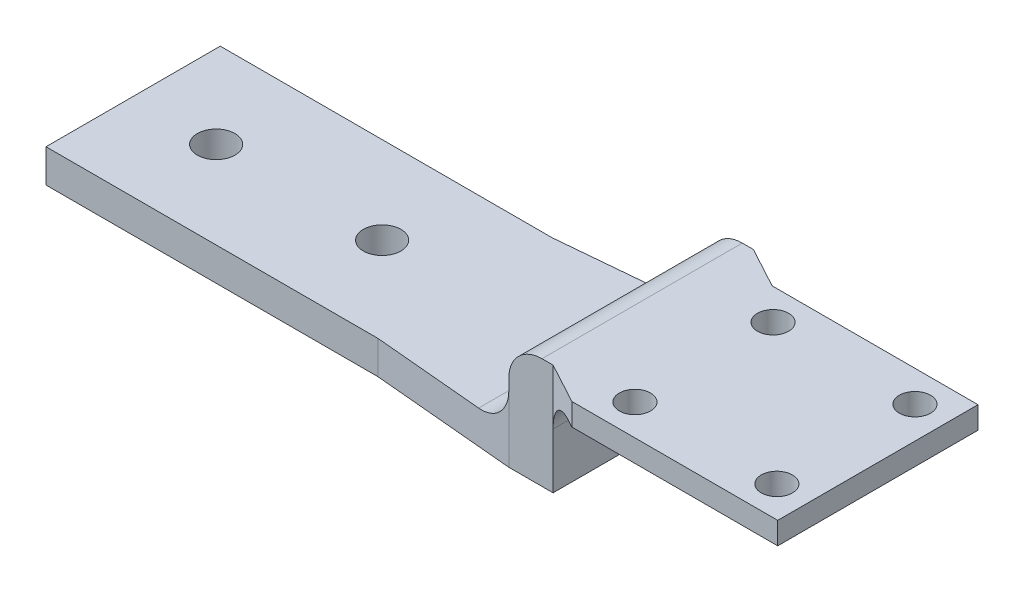
ISO-10303-21;
HEADER;
FILE_DESCRIPTION(('STEP AP214'),'2;1');
FILE_NAME('part.step','',(''),(''),'','','');
FILE_SCHEMA(('AUTOMOTIVE_DESIGN { 1 0 10303 214 1 1 1 1 }'));
ENDSEC;
DATA;
#1=APPLICATION_CONTEXT('core data for automotive mechanical design processes');
#2=APPLICATION_PROTOCOL_DEFINITION('international standard','automotive_design',2000,#1);
#3=PRODUCT_CONTEXT('',#1,'mechanical');
#4=PRODUCT('Part','Part','',(#3));
#5=PRODUCT_RELATED_PRODUCT_CATEGORY('part','',(#4));
#6=PRODUCT_DEFINITION_FORMATION('','',#4);
#7=PRODUCT_DEFINITION_CONTEXT('part definition',#1,'design');
#8=PRODUCT_DEFINITION('design','',#6,#7);
#9=PRODUCT_DEFINITION_SHAPE('','',#8);
#10=(LENGTH_UNIT() NAMED_UNIT(*) SI_UNIT(.MILLI.,.METRE.));
#11=(NAMED_UNIT(*) PLANE_ANGLE_UNIT() SI_UNIT($,.RADIAN.));
#12=(NAMED_UNIT(*) SI_UNIT($,.STERADIAN.) SOLID_ANGLE_UNIT());
#13=UNCERTAINTY_MEASURE_WITH_UNIT(LENGTH_MEASURE(1.E-05),#10,'distance_accuracy_value','');
#14=(GEOMETRIC_REPRESENTATION_CONTEXT(3) GLOBAL_UNCERTAINTY_ASSIGNED_CONTEXT((#13)) GLOBAL_UNIT_ASSIGNED_CONTEXT((#10,
#11,#12)) REPRESENTATION_CONTEXT('',''));
#15=CARTESIAN_POINT('',(0.,0.,0.));
#16=DIRECTION('',(0.,0.,1.));
#17=DIRECTION('',(1.,0.,0.));
#18=AXIS2_PLACEMENT_3D('',#15,#16,#17);
#19=CARTESIAN_POINT('',(59.69,1.905,0.));
#20=DIRECTION('',(1.,0.,0.));
#21=DIRECTION('',(0.,0.,-1.));
#22=AXIS2_PLACEMENT_3D('',#19,#20,#21);
#23=PLANE('',#22);
#24=DIRECTION('',(0.,-1.,0.));
#25=VECTOR('',#24,1.);
#26=CARTESIAN_POINT('',(59.69,1.90499999999998,-21.4935));
#27=LINE('',#26,#25);
#28=CARTESIAN_POINT('',(59.69,4.44499999999999,-21.4935));
#29=VERTEX_POINT('',#28);
#30=CARTESIAN_POINT('',(59.69,-1.90500000000002,-21.4935));
#31=VERTEX_POINT('',#30);
#32=EDGE_CURVE('E197',#29,#31,#27,.T.);
#33=ORIENTED_EDGE('',*,*,#32,.F.);
#34=DIRECTION('',(0.,0.,1.));
#35=VECTOR('',#34,1.);
#36=CARTESIAN_POINT('',(59.69,4.44499999999999,0.));
#37=LINE('',#36,#35);
#38=CARTESIAN_POINT('',(59.69,4.44499999999999,1.4935));
#39=VERTEX_POINT('',#38);
#40=EDGE_CURVE('E266',#29,#39,#37,.T.);
#41=ORIENTED_EDGE('',*,*,#40,.T.);
#42=DIRECTION('',(0.,-1.,0.));
#43=VECTOR('',#42,1.);
#44=CARTESIAN_POINT('',(59.69,1.90500000000001,1.4935));
#45=LINE('',#44,#43);
#46=CARTESIAN_POINT('',(59.69,-1.90499999999999,1.49350000000001));
#47=VERTEX_POINT('',#46);
#48=EDGE_CURVE('E194',#39,#47,#45,.T.);
#49=ORIENTED_EDGE('',*,*,#48,.T.);
#50=DIRECTION('',(0.,0.,1.));
#51=VECTOR('',#50,1.);
#52=CARTESIAN_POINT('',(59.69,-1.90499999999999,0.));
#53=LINE('',#52,#51);
#54=EDGE_CURVE('E167',#31,#47,#53,.T.);
#55=ORIENTED_EDGE('',*,*,#54,.F.);
#56=EDGE_LOOP('',(#33,#41,#49,#55));
#57=FACE_BOUND('',#56,.T.);
#58=ADVANCED_FACE('F45',(#57),#23,.T.);
#59=CARTESIAN_POINT('',(38.1,1.905,-20.));
#60=DIRECTION('',(0.,0.,-1.));
#61=DIRECTION('',(0.,1.,0.));
#62=AXIS2_PLACEMENT_3D('',#59,#60,#61);
#63=PLANE('',#62);
#64=DIRECTION('',(0.,-1.,0.));
#65=VECTOR('',#64,1.);
#66=CARTESIAN_POINT('',(0.,1.905,-20.));
#67=LINE('',#66,#65);
#68=CARTESIAN_POINT('',(0.,1.905,-20.));
#69=VERTEX_POINT('',#68);
#70=CARTESIAN_POINT('',(0.,-1.905,-20.));
#71=VERTEX_POINT('',#70);
#72=EDGE_CURVE('E211',#69,#71,#67,.T.);
#73=ORIENTED_EDGE('',*,*,#72,.F.);
#74=DIRECTION('',(-1.,0.,0.));
#75=VECTOR('',#74,1.);
#76=CARTESIAN_POINT('',(38.1,1.905,-20.));
#77=LINE('',#76,#75);
#78=CARTESIAN_POINT('',(38.1,1.905,-20.));
#79=VERTEX_POINT('',#78);
#80=EDGE_CURVE('E235',#79,#69,#77,.T.);
#81=ORIENTED_EDGE('',*,*,#80,.F.);
#82=DIRECTION('',(0.,-1.,0.));
#83=VECTOR('',#82,1.);
#84=CARTESIAN_POINT('',(38.1,1.905,-20.));
#85=LINE('',#84,#83);
#86=CARTESIAN_POINT('',(38.1,-1.905,-20.));
#87=VERTEX_POINT('',#86);
#88=EDGE_CURVE('E128',#79,#87,#85,.T.);
#89=ORIENTED_EDGE('',*,*,#88,.T.);
#90=DIRECTION('',(-1.,0.,0.));
#91=VECTOR('',#90,1.);
#92=CARTESIAN_POINT('',(38.1,-1.905,-20.));
#93=LINE('',#92,#91);
#94=EDGE_CURVE('E230',#87,#71,#93,.T.);
#95=ORIENTED_EDGE('',*,*,#94,.T.);
#96=EDGE_LOOP('',(#73,#81,#89,#95));
#97=FACE_BOUND('',#96,.T.);
#98=ADVANCED_FACE('F423',(#97),#63,.T.);
#99=CARTESIAN_POINT('',(38.1,1.905,0.));
#100=DIRECTION('',(0.,1.,0.));
#101=DIRECTION('',(0.,0.,1.));
#102=AXIS2_PLACEMENT_3D('',#99,#100,#101);
#103=PLANE('',#102);
#104=DIRECTION('',(0.995933405585129,0.,0.0900924616136522));
#105=VECTOR('',#104,1.);
#106=CARTESIAN_POINT('',(0.309244427469042,1.905,-3.41856410948367));
#107=LINE('',#106,#105);
#108=CARTESIAN_POINT('',(38.1,1.905,0.));
#109=VERTEX_POINT('',#108);
#110=CARTESIAN_POINT('',(50.8,1.90500000000001,1.14884615384616));
#111=VERTEX_POINT('',#110);
#112=EDGE_CURVE('E115',#109,#111,#107,.T.);
#113=ORIENTED_EDGE('',*,*,#112,.T.);
#114=DIRECTION('',(0.,0.,1.));
#115=VECTOR('',#114,1.);
#116=CARTESIAN_POINT('',(50.8,1.905,0.));
#117=LINE('',#116,#115);
#118=CARTESIAN_POINT('',(50.8,1.90499999999998,-21.1488461538462));
#119=VERTEX_POINT('',#118);
#120=EDGE_CURVE('E106',#111,#119,#117,.F.);
#121=ORIENTED_EDGE('',*,*,#120,.T.);
#122=DIRECTION('',(0.995933405585129,0.,-0.0900924616136508));
#123=VECTOR('',#122,1.);
#124=CARTESIAN_POINT('',(-1.48527741477958,1.90499999999999,-16.4191028577243));
#125=LINE('',#124,#123);
#126=EDGE_CURVE('E112',#79,#119,#125,.T.);
#127=ORIENTED_EDGE('',*,*,#126,.F.);
#128=ORIENTED_EDGE('',*,*,#80,.T.);
#129=DIRECTION('',(0.,0.,-1.));
#130=VECTOR('',#129,1.);
#131=CARTESIAN_POINT('',(0.,1.905,0.));
#132=LINE('',#131,#130);
#133=CARTESIAN_POINT('',(0.,1.905,0.));
#134=VERTEX_POINT('',#133);
#135=EDGE_CURVE('E223',#134,#69,#132,.T.);
#136=ORIENTED_EDGE('',*,*,#135,.F.);
#137=DIRECTION('',(-1.,0.,0.));
#138=VECTOR('',#137,1.);
#139=CARTESIAN_POINT('',(38.1,1.905,0.));
#140=LINE('',#139,#138);
#141=EDGE_CURVE('E238',#109,#134,#140,.T.);
#142=ORIENTED_EDGE('',*,*,#141,.F.);
#143=EDGE_LOOP('',(#113,#121,#127,#128,#136,#142));
#144=FACE_BOUND('',#143,.T.);
#145=CARTESIAN_POINT('',(28.575,1.905,-10.));
#146=DIRECTION('',(0.,1.,0.));
#147=DIRECTION('',(0.,0.,1.));
#148=AXIS2_PLACEMENT_3D('',#145,#146,#147);
#149=CIRCLE('',#148,2.15702401148296);
#150=CARTESIAN_POINT('',(28.575,1.905,-7.84297598851704));
#151=VERTEX_POINT('',#150);
#152=EDGE_CURVE('E203',#151,#151,#149,.T.);
#153=ORIENTED_EDGE('',*,*,#152,.F.);
#154=EDGE_LOOP('',(#153));
#155=FACE_BOUND('',#154,.T.);
#156=CARTESIAN_POINT('',(9.525,1.905,-10.));
#157=DIRECTION('',(0.,1.,0.));
#158=DIRECTION('',(0.,0.,1.));
#159=AXIS2_PLACEMENT_3D('',#156,#157,#158);
#160=CIRCLE('',#159,2.15702401148296);
#161=CARTESIAN_POINT('',(9.525,1.905,-7.84297598851705));
#162=VERTEX_POINT('',#161);
#163=EDGE_CURVE('E208',#162,#162,#160,.T.);
#164=ORIENTED_EDGE('',*,*,#163,.F.);
#165=EDGE_LOOP('',(#164));
#166=FACE_BOUND('',#165,.T.);
#167=ADVANCED_FACE('F108',(#144,#155,#166),#103,.T.);
#168=CARTESIAN_POINT('',(38.1,1.905,0.));
#169=DIRECTION('',(0.,0.,-1.));
#170=DIRECTION('',(0.,1.,0.));
#171=AXIS2_PLACEMENT_3D('',#168,#169,#170);
#172=PLANE('',#171);
#173=DIRECTION('',(0.,-1.,0.));
#174=VECTOR('',#173,1.);
#175=CARTESIAN_POINT('',(0.,1.905,0.));
#176=LINE('',#175,#174);
#177=CARTESIAN_POINT('',(0.,-1.90499999999999,0.));
#178=VERTEX_POINT('',#177);
#179=EDGE_CURVE('E219',#134,#178,#176,.T.);
#180=ORIENTED_EDGE('',*,*,#179,.T.);
#181=DIRECTION('',(-1.,0.,0.));
#182=VECTOR('',#181,1.);
#183=CARTESIAN_POINT('',(38.1,-1.90499999999999,0.));
#184=LINE('',#183,#182);
#185=CARTESIAN_POINT('',(38.1,-1.90499999999999,0.));
#186=VERTEX_POINT('',#185);
#187=EDGE_CURVE('E214',#186,#178,#184,.T.);
#188=ORIENTED_EDGE('',*,*,#187,.F.);
#189=DIRECTION('',(0.,-1.,0.));
#190=VECTOR('',#189,1.);
#191=CARTESIAN_POINT('',(38.1,1.905,0.));
#192=LINE('',#191,#190);
#193=EDGE_CURVE('E158',#109,#186,#192,.T.);
#194=ORIENTED_EDGE('',*,*,#193,.F.);
#195=ORIENTED_EDGE('',*,*,#141,.T.);
#196=EDGE_LOOP('',(#180,#188,#194,#195));
#197=FACE_BOUND('',#196,.T.);
#198=ADVANCED_FACE('F466',(#197),#172,.F.);
#199=CARTESIAN_POINT('',(38.1,-1.905,-4.91999999999996));
#200=DIRECTION('',(0.,-1.,0.));
#201=DIRECTION('',(0.,0.,-1.));
#202=AXIS2_PLACEMENT_3D('',#199,#200,#201);
#203=PLANE('',#202);
#204=CARTESIAN_POINT('',(9.525,-1.90500000000001,-10.));
#205=DIRECTION('',(0.,-1.,0.));
#206=DIRECTION('',(0.,0.,-1.));
#207=AXIS2_PLACEMENT_3D('',#204,#205,#206);
#208=CIRCLE('',#207,3.21475100000001);
#209=CARTESIAN_POINT('',(9.525,-1.90500000000001,-13.214751));
#210=VERTEX_POINT('',#209);
#211=EDGE_CURVE('E258',#210,#210,#208,.F.);
#212=ORIENTED_EDGE('',*,*,#211,.T.);
#213=EDGE_LOOP('',(#212));
#214=FACE_BOUND('',#213,.T.);
#215=CARTESIAN_POINT('',(28.575,-1.90500000000001,-10.));
#216=DIRECTION('',(0.,-1.,0.));
#217=DIRECTION('',(0.,0.,-1.));
#218=AXIS2_PLACEMENT_3D('',#215,#216,#217);
#219=CIRCLE('',#218,3.21475100000001);
#220=CARTESIAN_POINT('',(28.575,-1.90500000000001,-13.214751));
#221=VERTEX_POINT('',#220);
#222=EDGE_CURVE('E254',#221,#221,#219,.F.);
#223=ORIENTED_EDGE('',*,*,#222,.T.);
#224=EDGE_LOOP('',(#223));
#225=FACE_BOUND('',#224,.T.);
#226=DIRECTION('',(0.,0.,1.));
#227=VECTOR('',#226,1.);
#228=CARTESIAN_POINT('',(0.,-1.905,-4.91999999999996));
#229=LINE('',#228,#227);
#230=EDGE_CURVE('E215',#71,#178,#229,.T.);
#231=ORIENTED_EDGE('',*,*,#230,.F.);
#232=ORIENTED_EDGE('',*,*,#94,.F.);
#233=DIRECTION('',(0.995933405585129,0.,-0.0900924616136508));
#234=VECTOR('',#233,1.);
#235=CARTESIAN_POINT('',(-1.48527741477958,-1.90500000000001,-16.4191028577243));
#236=LINE('',#235,#234);
#237=CARTESIAN_POINT('',(54.61,-1.90500000000002,-21.4935));
#238=VERTEX_POINT('',#237);
#239=EDGE_CURVE('E176',#87,#238,#236,.T.);
#240=ORIENTED_EDGE('',*,*,#239,.T.);
#241=DIRECTION('',(1.,0.,0.));
#242=VECTOR('',#241,1.);
#243=CARTESIAN_POINT('',(0.,-1.90500000000002,-21.4935));
#244=LINE('',#243,#242);
#245=EDGE_CURVE('E180',#238,#31,#244,.T.);
#246=ORIENTED_EDGE('',*,*,#245,.T.);
#247=ORIENTED_EDGE('',*,*,#54,.T.);
#248=DIRECTION('',(-1.,0.,0.));
#249=VECTOR('',#248,1.);
#250=CARTESIAN_POINT('',(0.,-1.90499999999999,1.49350000000001));
#251=LINE('',#250,#249);
#252=CARTESIAN_POINT('',(54.61,-1.90499999999999,1.49350000000001));
#253=VERTEX_POINT('',#252);
#254=EDGE_CURVE('E163',#47,#253,#251,.T.);
#255=ORIENTED_EDGE('',*,*,#254,.T.);
#256=DIRECTION('',(0.995933405585129,0.,0.0900924616136522));
#257=VECTOR('',#256,1.);
#258=CARTESIAN_POINT('',(0.309244427469042,-1.905,-3.41856410948366));
#259=LINE('',#258,#257);
#260=EDGE_CURVE('E173',#186,#253,#259,.T.);
#261=ORIENTED_EDGE('',*,*,#260,.F.);
#262=ORIENTED_EDGE('',*,*,#187,.T.);
#263=EDGE_LOOP('',(#231,#232,#240,#246,#247,#255,#261,#262));
#264=FACE_BOUND('',#263,.T.);
#265=ADVANCED_FACE('F461',(#214,#225,#264),#203,.T.);
#266=CARTESIAN_POINT('',(0.,0.,0.));
#267=DIRECTION('',(1.,0.,0.));
#268=DIRECTION('',(0.,0.,-1.));
#269=AXIS2_PLACEMENT_3D('',#266,#267,#268);
#270=PLANE('',#269);
#271=ORIENTED_EDGE('',*,*,#72,.T.);
#272=ORIENTED_EDGE('',*,*,#230,.T.);
#273=ORIENTED_EDGE('',*,*,#179,.F.);
#274=ORIENTED_EDGE('',*,*,#135,.T.);
#275=EDGE_LOOP('',(#271,#272,#273,#274));
#276=FACE_BOUND('',#275,.T.);
#277=ADVANCED_FACE('F458',(#276),#270,.F.);
#278=CARTESIAN_POINT('',(9.525,1.65099999999999,-10.));
#279=DIRECTION('',(0.,-1.,0.));
#280=DIRECTION('',(0.,0.,-1.));
#281=AXIS2_PLACEMENT_3D('',#278,#279,#280);
#282=CONICAL_SURFACE('',#281,2.579751,1.02974425867665);
#283=ORIENTED_EDGE('',*,*,#163,.T.);
#284=EDGE_LOOP('',(#283));
#285=FACE_BOUND('',#284,.T.);
#286=CARTESIAN_POINT('',(9.525,1.65099999999999,-10.));
#287=DIRECTION('',(0.,-1.,0.));
#288=DIRECTION('',(0.,0.,-1.));
#289=AXIS2_PLACEMENT_3D('',#286,#287,#288);
#290=CIRCLE('',#289,2.579751);
#291=CARTESIAN_POINT('',(9.525,1.65099999999999,-12.579751));
#292=VERTEX_POINT('',#291);
#293=EDGE_CURVE('E204',#292,#292,#290,.T.);
#294=ORIENTED_EDGE('',*,*,#293,.T.);
#295=EDGE_LOOP('',(#294));
#296=FACE_BOUND('',#295,.T.);
#297=ADVANCED_FACE('F454',(#285,#296),#282,.F.);
#298=CARTESIAN_POINT('',(9.525,-1.90500000000001,-10.));
#299=DIRECTION('',(0.,-1.,0.));
#300=DIRECTION('',(0.,0.,-1.));
#301=AXIS2_PLACEMENT_3D('',#298,#299,#300);
#302=CYLINDRICAL_SURFACE('',#301,2.579751);
#303=CARTESIAN_POINT('',(9.525,-1.53838257906459,-10.));
#304=DIRECTION('',(0.,-1.,0.));
#305=DIRECTION('',(0.,0.,-1.));
#306=AXIS2_PLACEMENT_3D('',#303,#304,#305);
#307=CIRCLE('',#306,2.579751);
#308=CARTESIAN_POINT('',(9.525,-1.53838257906459,-12.579751));
#309=VERTEX_POINT('',#308);
#310=EDGE_CURVE('E234',#309,#309,#307,.T.);
#311=ORIENTED_EDGE('',*,*,#310,.T.);
#312=EDGE_LOOP('',(#311));
#313=FACE_BOUND('',#312,.T.);
#314=ORIENTED_EDGE('',*,*,#293,.F.);
#315=EDGE_LOOP('',(#314));
#316=FACE_BOUND('',#315,.T.);
#317=ADVANCED_FACE('F450',(#313,#316),#302,.F.);
#318=CARTESIAN_POINT('',(28.575,1.65099999999999,-10.));
#319=DIRECTION('',(0.,-1.,0.));
#320=DIRECTION('',(0.,0.,-1.));
#321=AXIS2_PLACEMENT_3D('',#318,#319,#320);
#322=CONICAL_SURFACE('',#321,2.579751,1.02974425867665);
#323=ORIENTED_EDGE('',*,*,#152,.T.);
#324=EDGE_LOOP('',(#323));
#325=FACE_BOUND('',#324,.T.);
#326=CARTESIAN_POINT('',(28.575,1.65099999999999,-10.));
#327=DIRECTION('',(0.,-1.,0.));
#328=DIRECTION('',(0.,0.,-1.));
#329=AXIS2_PLACEMENT_3D('',#326,#327,#328);
#330=CIRCLE('',#329,2.579751);
#331=CARTESIAN_POINT('',(28.575,1.65099999999999,-12.579751));
#332=VERTEX_POINT('',#331);
#333=EDGE_CURVE('E189',#332,#332,#330,.T.);
#334=ORIENTED_EDGE('',*,*,#333,.T.);
#335=EDGE_LOOP('',(#334));
#336=FACE_BOUND('',#335,.T.);
#337=ADVANCED_FACE('F446',(#325,#336),#322,.F.);
#338=CARTESIAN_POINT('',(28.575,-1.90500000000001,-10.));
#339=DIRECTION('',(0.,-1.,0.));
#340=DIRECTION('',(0.,0.,-1.));
#341=AXIS2_PLACEMENT_3D('',#338,#339,#340);
#342=CYLINDRICAL_SURFACE('',#341,2.579751);
#343=CARTESIAN_POINT('',(28.575,-1.53838257906459,-10.));
#344=DIRECTION('',(0.,-1.,0.));
#345=DIRECTION('',(0.,0.,-1.));
#346=AXIS2_PLACEMENT_3D('',#343,#344,#345);
#347=CIRCLE('',#346,2.579751);
#348=CARTESIAN_POINT('',(28.575,-1.53838257906459,-12.579751));
#349=VERTEX_POINT('',#348);
#350=EDGE_CURVE('E262',#349,#349,#347,.T.);
#351=ORIENTED_EDGE('',*,*,#350,.T.);
#352=EDGE_LOOP('',(#351));
#353=FACE_BOUND('',#352,.T.);
#354=ORIENTED_EDGE('',*,*,#333,.F.);
#355=EDGE_LOOP('',(#354));
#356=FACE_BOUND('',#355,.T.);
#357=ADVANCED_FACE('F442',(#353,#356),#342,.F.);
#358=CARTESIAN_POINT('',(9.525,-1.53838257906459,-10.));
#359=DIRECTION('',(0.,-1.,0.));
#360=DIRECTION('',(0.,0.,-1.));
#361=AXIS2_PLACEMENT_3D('',#358,#359,#360);
#362=CONICAL_SURFACE('',#361,2.579751,1.0471975511966);
#363=ORIENTED_EDGE('',*,*,#211,.F.);
#364=EDGE_LOOP('',(#363));
#365=FACE_BOUND('',#364,.T.);
#366=ORIENTED_EDGE('',*,*,#310,.F.);
#367=EDGE_LOOP('',(#366));
#368=FACE_BOUND('',#367,.T.);
#369=ADVANCED_FACE('F445',(#365,#368),#362,.F.);
#370=CARTESIAN_POINT('',(28.575,-1.53838257906459,-10.));
#371=DIRECTION('',(0.,-1.,0.));
#372=DIRECTION('',(0.,0.,-1.));
#373=AXIS2_PLACEMENT_3D('',#370,#371,#372);
#374=CONICAL_SURFACE('',#373,2.579751,1.0471975511966);
#375=ORIENTED_EDGE('',*,*,#222,.F.);
#376=EDGE_LOOP('',(#375));
#377=FACE_BOUND('',#376,.T.);
#378=ORIENTED_EDGE('',*,*,#350,.F.);
#379=EDGE_LOOP('',(#378));
#380=FACE_BOUND('',#379,.T.);
#381=ADVANCED_FACE('F441',(#377,#380),#374,.F.);
#382=CARTESIAN_POINT('',(0.309244427469042,1.905,-3.41856410948367));
#383=DIRECTION('',(0.0900924616136522,0.,-0.995933405585129));
#384=DIRECTION('',(-0.995933405585129,0.,-0.0900924616136522));
#385=AXIS2_PLACEMENT_3D('',#382,#383,#384);
#386=PLANE('',#385);
#387=ORIENTED_EDGE('',*,*,#260,.T.);
#388=DIRECTION('',(0.,-1.,0.));
#389=VECTOR('',#388,1.);
#390=CARTESIAN_POINT('',(54.61,1.90500000000001,1.4935));
#391=LINE('',#390,#389);
#392=CARTESIAN_POINT('',(54.61,5.715,1.4935));
#393=VERTEX_POINT('',#392);
#394=EDGE_CURVE('E83',#393,#253,#391,.T.);
#395=ORIENTED_EDGE('',*,*,#394,.F.);
#396=CARTESIAN_POINT('',(50.8,5.715,1.14884615384615));
#397=DIRECTION('',(0.0900924616136522,0.,-0.995933405585129));
#398=DIRECTION('',(0.995933405585129,0.,0.0900924616136522));
#399=AXIS2_PLACEMENT_3D('',#396,#397,#398);
#400=ELLIPSE('',#399,3.82555698868395,3.81);
#401=EDGE_CURVE('E54',#393,#111,#400,.T.);
#402=ORIENTED_EDGE('',*,*,#401,.T.);
#403=ORIENTED_EDGE('',*,*,#112,.F.);
#404=ORIENTED_EDGE('',*,*,#193,.T.);
#405=EDGE_LOOP('',(#387,#395,#402,#403,#404));
#406=FACE_BOUND('',#405,.T.);
#407=ADVANCED_FACE('F153',(#406),#386,.F.);
#408=CARTESIAN_POINT('',(0.,1.90500000000001,1.49350000000001));
#409=DIRECTION('',(0.,0.,1.));
#410=DIRECTION('',(0.,-1.,0.));
#411=AXIS2_PLACEMENT_3D('',#408,#409,#410);
#412=PLANE('',#411);
#413=DIRECTION('',(1.,0.,0.));
#414=VECTOR('',#413,1.);
#415=CARTESIAN_POINT('',(59.69,10.795,1.4935));
#416=LINE('',#415,#414);
#417=CARTESIAN_POINT('',(58.42,10.795,1.4935));
#418=VERTEX_POINT('',#417);
#419=CARTESIAN_POINT('',(59.69,10.795,1.4935));
#420=VERTEX_POINT('',#419);
#421=EDGE_CURVE('E283',#418,#420,#416,.T.);
#422=ORIENTED_EDGE('',*,*,#421,.F.);
#423=CARTESIAN_POINT('',(58.42,6.985,1.4935));
#424=DIRECTION('',(0.,0.,1.));
#425=DIRECTION('',(0.,-1.,0.));
#426=AXIS2_PLACEMENT_3D('',#423,#424,#425);
#427=CIRCLE('',#426,3.81);
#428=CARTESIAN_POINT('',(54.61,6.985,1.4935));
#429=VERTEX_POINT('',#428);
#430=EDGE_CURVE('E94',#418,#429,#427,.T.);
#431=ORIENTED_EDGE('',*,*,#430,.T.);
#432=DIRECTION('',(0.,-1.,0.));
#433=VECTOR('',#432,1.);
#434=CARTESIAN_POINT('',(54.61,10.795,1.4935));
#435=LINE('',#434,#433);
#436=EDGE_CURVE('E294',#429,#393,#435,.T.);
#437=ORIENTED_EDGE('',*,*,#436,.T.);
#438=ORIENTED_EDGE('',*,*,#394,.T.);
#439=ORIENTED_EDGE('',*,*,#254,.F.);
#440=ORIENTED_EDGE('',*,*,#48,.F.);
#441=EDGE_CURVE('E190',#420,#39,#45,.T.);
#442=ORIENTED_EDGE('',*,*,#441,.F.);
#443=EDGE_LOOP('',(#422,#431,#437,#438,#439,#440,#442));
#444=FACE_BOUND('',#443,.T.);
#445=ADVANCED_FACE('F291',(#444),#412,.T.);
#446=CARTESIAN_POINT('',(0.,1.90499999999998,-21.4935));
#447=DIRECTION('',(0.,0.,-1.));
#448=DIRECTION('',(0.,1.,0.));
#449=AXIS2_PLACEMENT_3D('',#446,#447,#448);
#450=PLANE('',#449);
#451=DIRECTION('',(0.,-1.,0.));
#452=VECTOR('',#451,1.);
#453=CARTESIAN_POINT('',(54.61,10.795,-21.4935));
#454=LINE('',#453,#452);
#455=CARTESIAN_POINT('',(54.61,6.985,-21.4935));
#456=VERTEX_POINT('',#455);
#457=CARTESIAN_POINT('',(54.61,5.715,-21.4935));
#458=VERTEX_POINT('',#457);
#459=EDGE_CURVE('E170',#456,#458,#454,.T.);
#460=ORIENTED_EDGE('',*,*,#459,.F.);
#461=CARTESIAN_POINT('',(58.42,6.985,-21.4935));
#462=DIRECTION('',(0.,0.,-1.));
#463=DIRECTION('',(0.,1.,0.));
#464=AXIS2_PLACEMENT_3D('',#461,#462,#463);
#465=CIRCLE('',#464,3.81);
#466=CARTESIAN_POINT('',(58.42,10.795,-21.4935));
#467=VERTEX_POINT('',#466);
#468=EDGE_CURVE('E120',#456,#467,#465,.T.);
#469=ORIENTED_EDGE('',*,*,#468,.T.);
#470=DIRECTION('',(-1.,0.,0.));
#471=VECTOR('',#470,1.);
#472=CARTESIAN_POINT('',(59.69,10.795,-21.4935));
#473=LINE('',#472,#471);
#474=CARTESIAN_POINT('',(59.69,10.795,-21.4935));
#475=VERTEX_POINT('',#474);
#476=EDGE_CURVE('E286',#475,#467,#473,.T.);
#477=ORIENTED_EDGE('',*,*,#476,.F.);
#478=EDGE_CURVE('E69',#475,#29,#27,.T.);
#479=ORIENTED_EDGE('',*,*,#478,.T.);
#480=ORIENTED_EDGE('',*,*,#32,.T.);
#481=ORIENTED_EDGE('',*,*,#245,.F.);
#482=DIRECTION('',(0.,-1.,0.));
#483=VECTOR('',#482,1.);
#484=CARTESIAN_POINT('',(54.61,1.90499999999998,-21.4935));
#485=LINE('',#484,#483);
#486=EDGE_CURVE('E61',#458,#238,#485,.T.);
#487=ORIENTED_EDGE('',*,*,#486,.F.);
#488=EDGE_LOOP('',(#460,#469,#477,#479,#480,#481,#487));
#489=FACE_BOUND('',#488,.T.);
#490=ADVANCED_FACE('F434',(#489),#450,.T.);
#491=CARTESIAN_POINT('',(-1.48527741477958,1.90499999999999,-16.4191028577243));
#492=DIRECTION('',(-0.0900924616136508,0.,-0.995933405585129));
#493=DIRECTION('',(-0.995933405585129,0.,0.0900924616136508));
#494=AXIS2_PLACEMENT_3D('',#491,#492,#493);
#495=PLANE('',#494);
#496=ORIENTED_EDGE('',*,*,#239,.F.);
#497=ORIENTED_EDGE('',*,*,#88,.F.);
#498=ORIENTED_EDGE('',*,*,#126,.T.);
#499=CARTESIAN_POINT('',(50.8,5.715,-21.1488461538462));
#500=DIRECTION('',(-0.0900924616136508,0.,-0.995933405585129));
#501=DIRECTION('',(-0.995933405585129,0.,0.0900924616136508));
#502=AXIS2_PLACEMENT_3D('',#499,#500,#501);
#503=ELLIPSE('',#502,3.82555698868395,3.81);
#504=EDGE_CURVE('E11',#119,#458,#503,.F.);
#505=ORIENTED_EDGE('',*,*,#504,.T.);
#506=ORIENTED_EDGE('',*,*,#486,.T.);
#507=EDGE_LOOP('',(#496,#497,#498,#505,#506));
#508=FACE_BOUND('',#507,.T.);
#509=ADVANCED_FACE('F125',(#508),#495,.T.);
#510=CARTESIAN_POINT('',(54.61,10.795,-21.4935));
#511=DIRECTION('',(1.,0.,0.));
#512=DIRECTION('',(0.,0.,-1.));
#513=AXIS2_PLACEMENT_3D('',#510,#511,#512);
#514=PLANE('',#513);
#515=ORIENTED_EDGE('',*,*,#436,.F.);
#516=DIRECTION('',(0.,0.,1.));
#517=VECTOR('',#516,1.);
#518=CARTESIAN_POINT('',(54.61,6.985,-21.4935));
#519=LINE('',#518,#517);
#520=EDGE_CURVE('E135',#429,#456,#519,.F.);
#521=ORIENTED_EDGE('',*,*,#520,.T.);
#522=ORIENTED_EDGE('',*,*,#459,.T.);
#523=DIRECTION('',(0.,0.,1.));
#524=VECTOR('',#523,1.);
#525=CARTESIAN_POINT('',(54.61,5.715,-21.4935));
#526=LINE('',#525,#524);
#527=EDGE_CURVE('E132',#458,#393,#526,.T.);
#528=ORIENTED_EDGE('',*,*,#527,.T.);
#529=EDGE_LOOP('',(#515,#521,#522,#528));
#530=FACE_BOUND('',#529,.T.);
#531=ADVANCED_FACE('F400',(#530),#514,.F.);
#532=CARTESIAN_POINT('',(0.,10.795,0.));
#533=DIRECTION('',(0.,-1.,0.));
#534=DIRECTION('',(0.,0.,-1.));
#535=AXIS2_PLACEMENT_3D('',#532,#533,#534);
#536=PLANE('',#535);
#537=ORIENTED_EDGE('',*,*,#476,.T.);
#538=DIRECTION('',(0.,0.,1.));
#539=VECTOR('',#538,1.);
#540=CARTESIAN_POINT('',(58.42,10.795,0.));
#541=LINE('',#540,#539);
#542=EDGE_CURVE('E140',#467,#418,#541,.T.);
#543=ORIENTED_EDGE('',*,*,#542,.T.);
#544=ORIENTED_EDGE('',*,*,#421,.T.);
#545=DIRECTION('',(0.879706513576127,0.,0.475517034365474));
#546=VECTOR('',#545,1.);
#547=CARTESIAN_POINT('',(59.69,10.795,1.4935));
#548=LINE('',#547,#546);
#549=CARTESIAN_POINT('',(64.389,10.795,4.03350000000001));
#550=VERTEX_POINT('',#549);
#551=EDGE_CURVE('E333',#420,#550,#548,.T.);
#552=ORIENTED_EDGE('',*,*,#551,.T.);
#553=DIRECTION('',(1.,0.,0.));
#554=VECTOR('',#553,1.);
#555=CARTESIAN_POINT('',(64.389,10.795,4.03350000000001));
#556=LINE('',#555,#554);
#557=CARTESIAN_POINT('',(88.011,10.795,4.03350000000001));
#558=VERTEX_POINT('',#557);
#559=EDGE_CURVE('E329',#550,#558,#556,.T.);
#560=ORIENTED_EDGE('',*,*,#559,.T.);
#561=DIRECTION('',(0.,0.,-1.));
#562=VECTOR('',#561,1.);
#563=CARTESIAN_POINT('',(88.011,10.795,4.03350000000001));
#564=LINE('',#563,#562);
#565=CARTESIAN_POINT('',(88.011,10.795,-18.9535));
#566=VERTEX_POINT('',#565);
#567=EDGE_CURVE('E325',#558,#566,#564,.T.);
#568=ORIENTED_EDGE('',*,*,#567,.T.);
#569=DIRECTION('',(-1.,0.,0.));
#570=VECTOR('',#569,1.);
#571=CARTESIAN_POINT('',(64.389,10.795,-18.9535));
#572=LINE('',#571,#570);
#573=CARTESIAN_POINT('',(64.389,10.795,-18.9535));
#574=VERTEX_POINT('',#573);
#575=EDGE_CURVE('E321',#566,#574,#572,.T.);
#576=ORIENTED_EDGE('',*,*,#575,.T.);
#577=DIRECTION('',(-0.879706513576127,0.,-0.475517034365475));
#578=VECTOR('',#577,1.);
#579=CARTESIAN_POINT('',(64.389,10.795,-18.9535));
#580=LINE('',#579,#578);
#581=EDGE_CURVE('E317',#574,#475,#580,.T.);
#582=ORIENTED_EDGE('',*,*,#581,.T.);
#583=EDGE_LOOP('',(#537,#543,#544,#552,#560,#568,#576,#582));
#584=FACE_BOUND('',#583,.T.);
#585=CARTESIAN_POINT('',(68.0562828729282,10.795,0.464800000000005));
#586=DIRECTION('',(0.,1.,0.));
#587=DIRECTION('',(0.,0.,1.));
#588=AXIS2_PLACEMENT_3D('',#585,#586,#587);
#589=CIRCLE('',#588,1.79070000000001);
#590=CARTESIAN_POINT('',(68.0562828729282,10.795,2.25550000000001));
#591=VERTEX_POINT('',#590);
#592=EDGE_CURVE('E379',#591,#591,#589,.T.);
#593=ORIENTED_EDGE('',*,*,#592,.F.);
#594=EDGE_LOOP('',(#593));
#595=FACE_BOUND('',#594,.T.);
#596=CARTESIAN_POINT('',(84.3437171270718,10.795,0.464800000000005));
#597=DIRECTION('',(0.,1.,0.));
#598=DIRECTION('',(0.,0.,1.));
#599=AXIS2_PLACEMENT_3D('',#596,#597,#598);
#600=CIRCLE('',#599,1.79070000000001);
#601=CARTESIAN_POINT('',(84.3437171270718,10.795,2.25550000000001));
#602=VERTEX_POINT('',#601);
#603=EDGE_CURVE('E371',#602,#602,#600,.T.);
#604=ORIENTED_EDGE('',*,*,#603,.F.);
#605=EDGE_LOOP('',(#604));
#606=FACE_BOUND('',#605,.T.);
#607=CARTESIAN_POINT('',(84.3437171270718,10.795,-15.3848));
#608=DIRECTION('',(0.,1.,0.));
#609=DIRECTION('',(0.,0.,1.));
#610=AXIS2_PLACEMENT_3D('',#607,#608,#609);
#611=CIRCLE('',#610,1.79070000000001);
#612=CARTESIAN_POINT('',(84.3437171270718,10.795,-13.5941));
#613=VERTEX_POINT('',#612);
#614=EDGE_CURVE('E363',#613,#613,#611,.T.);
#615=ORIENTED_EDGE('',*,*,#614,.F.);
#616=EDGE_LOOP('',(#615));
#617=FACE_BOUND('',#616,.T.);
#618=CARTESIAN_POINT('',(68.0562828729282,10.795,-15.3848));
#619=DIRECTION('',(0.,1.,0.));
#620=DIRECTION('',(0.,0.,1.));
#621=AXIS2_PLACEMENT_3D('',#618,#619,#620);
#622=CIRCLE('',#621,1.79070000000001);
#623=CARTESIAN_POINT('',(68.0562828729282,10.795,-13.5941));
#624=VERTEX_POINT('',#623);
#625=EDGE_CURVE('E355',#624,#624,#622,.T.);
#626=ORIENTED_EDGE('',*,*,#625,.F.);
#627=EDGE_LOOP('',(#626));
#628=FACE_BOUND('',#627,.T.);
#629=ADVANCED_FACE('F279',(#584,#595,#606,#617,#628),#536,.F.);
#630=CARTESIAN_POINT('',(59.69,8.255,1.4935));
#631=DIRECTION('',(-0.475517034365474,0.,0.879706513576127));
#632=DIRECTION('',(0.879706513576127,0.,0.475517034365474));
#633=AXIS2_PLACEMENT_3D('',#630,#631,#632);
#634=PLANE('',#633);
#635=ORIENTED_EDGE('',*,*,#551,.F.);
#636=ORIENTED_EDGE('',*,*,#441,.T.);
#637=CARTESIAN_POINT('',(63.5,4.44499999999999,3.55295945945946));
#638=DIRECTION('',(-0.475517034365474,0.,0.879706513576127));
#639=DIRECTION('',(0.879706513576127,0.,0.475517034365474));
#640=AXIS2_PLACEMENT_3D('',#637,#638,#639);
#641=ELLIPSE('',#640,4.33098987128313,3.81);
#642=CARTESIAN_POINT('',(63.5,8.255,3.55295945945946));
#643=VERTEX_POINT('',#642);
#644=EDGE_CURVE('E119',#39,#643,#641,.F.);
#645=ORIENTED_EDGE('',*,*,#644,.T.);
#646=DIRECTION('',(0.879706513576127,0.,0.475517034365474));
#647=VECTOR('',#646,1.);
#648=CARTESIAN_POINT('',(59.69,8.255,1.4935));
#649=LINE('',#648,#647);
#650=CARTESIAN_POINT('',(64.389,8.255,4.03350000000001));
#651=VERTEX_POINT('',#650);
#652=EDGE_CURVE('E320',#643,#651,#649,.T.);
#653=ORIENTED_EDGE('',*,*,#652,.T.);
#654=DIRECTION('',(0.,1.,0.));
#655=VECTOR('',#654,1.);
#656=CARTESIAN_POINT('',(64.389,8.255,4.03350000000001));
#657=LINE('',#656,#655);
#658=EDGE_CURVE('E301',#651,#550,#657,.T.);
#659=ORIENTED_EDGE('',*,*,#658,.T.);
#660=EDGE_LOOP('',(#635,#636,#645,#653,#659));
#661=FACE_BOUND('',#660,.T.);
#662=ADVANCED_FACE('F399',(#661),#634,.T.);
#663=CARTESIAN_POINT('',(64.389,8.255,-18.9535));
#664=DIRECTION('',(0.475517034365475,0.,-0.879706513576127));
#665=DIRECTION('',(-0.879706513576127,0.,-0.475517034365475));
#666=AXIS2_PLACEMENT_3D('',#663,#664,#665);
#667=PLANE('',#666);
#668=ORIENTED_EDGE('',*,*,#581,.F.);
#669=DIRECTION('',(0.,1.,0.));
#670=VECTOR('',#669,1.);
#671=CARTESIAN_POINT('',(64.389,8.255,-18.9535));
#672=LINE('',#671,#670);
#673=CARTESIAN_POINT('',(64.389,8.255,-18.9535));
#674=VERTEX_POINT('',#673);
#675=EDGE_CURVE('E298',#674,#574,#672,.T.);
#676=ORIENTED_EDGE('',*,*,#675,.F.);
#677=DIRECTION('',(-0.879706513576127,0.,-0.475517034365475));
#678=VECTOR('',#677,1.);
#679=CARTESIAN_POINT('',(64.389,8.255,-18.9535));
#680=LINE('',#679,#678);
#681=CARTESIAN_POINT('',(63.5,8.255,-19.4340405405405));
#682=VERTEX_POINT('',#681);
#683=EDGE_CURVE('E306',#674,#682,#680,.T.);
#684=ORIENTED_EDGE('',*,*,#683,.T.);
#685=CARTESIAN_POINT('',(63.5,4.445,-19.4340405405405));
#686=DIRECTION('',(0.475517034365475,0.,-0.879706513576127));
#687=DIRECTION('',(0.879706513576127,0.,0.475517034365475));
#688=AXIS2_PLACEMENT_3D('',#685,#686,#687);
#689=ELLIPSE('',#688,4.33098987128313,3.81);
#690=EDGE_CURVE('E149',#682,#29,#689,.F.);
#691=ORIENTED_EDGE('',*,*,#690,.T.);
#692=ORIENTED_EDGE('',*,*,#478,.F.);
#693=EDGE_LOOP('',(#668,#676,#684,#691,#692));
#694=FACE_BOUND('',#693,.T.);
#695=ADVANCED_FACE('F536',(#694),#667,.T.);
#696=CARTESIAN_POINT('',(64.389,8.255,-18.9535));
#697=DIRECTION('',(0.,0.,-1.));
#698=DIRECTION('',(0.,1.,0.));
#699=AXIS2_PLACEMENT_3D('',#696,#697,#698);
#700=PLANE('',#699);
#701=ORIENTED_EDGE('',*,*,#575,.F.);
#702=DIRECTION('',(0.,1.,0.));
#703=VECTOR('',#702,1.);
#704=CARTESIAN_POINT('',(88.011,8.255,-18.9535));
#705=LINE('',#704,#703);
#706=CARTESIAN_POINT('',(88.011,8.255,-18.9535));
#707=VERTEX_POINT('',#706);
#708=EDGE_CURVE('E310',#707,#566,#705,.T.);
#709=ORIENTED_EDGE('',*,*,#708,.F.);
#710=DIRECTION('',(-1.,0.,0.));
#711=VECTOR('',#710,1.);
#712=CARTESIAN_POINT('',(64.389,8.255,-18.9535));
#713=LINE('',#712,#711);
#714=EDGE_CURVE('E340',#707,#674,#713,.T.);
#715=ORIENTED_EDGE('',*,*,#714,.T.);
#716=ORIENTED_EDGE('',*,*,#675,.T.);
#717=EDGE_LOOP('',(#701,#709,#715,#716));
#718=FACE_BOUND('',#717,.T.);
#719=ADVANCED_FACE('F570',(#718),#700,.T.);
#720=CARTESIAN_POINT('',(88.011,8.255,4.03350000000001));
#721=DIRECTION('',(1.,0.,0.));
#722=DIRECTION('',(0.,0.,-1.));
#723=AXIS2_PLACEMENT_3D('',#720,#721,#722);
#724=PLANE('',#723);
#725=ORIENTED_EDGE('',*,*,#567,.F.);
#726=DIRECTION('',(0.,1.,0.));
#727=VECTOR('',#726,1.);
#728=CARTESIAN_POINT('',(88.011,8.255,4.03350000000001));
#729=LINE('',#728,#727);
#730=CARTESIAN_POINT('',(88.011,8.255,4.03350000000001));
#731=VERTEX_POINT('',#730);
#732=EDGE_CURVE('E305',#731,#558,#729,.T.);
#733=ORIENTED_EDGE('',*,*,#732,.F.);
#734=DIRECTION('',(0.,0.,-1.));
#735=VECTOR('',#734,1.);
#736=CARTESIAN_POINT('',(88.011,8.255,4.03350000000001));
#737=LINE('',#736,#735);
#738=EDGE_CURVE('E344',#731,#707,#737,.T.);
#739=ORIENTED_EDGE('',*,*,#738,.T.);
#740=ORIENTED_EDGE('',*,*,#708,.T.);
#741=EDGE_LOOP('',(#725,#733,#739,#740));
#742=FACE_BOUND('',#741,.T.);
#743=ADVANCED_FACE('F569',(#742),#724,.T.);
#744=CARTESIAN_POINT('',(64.389,8.255,4.03350000000001));
#745=DIRECTION('',(0.,0.,1.));
#746=DIRECTION('',(0.,-1.,0.));
#747=AXIS2_PLACEMENT_3D('',#744,#745,#746);
#748=PLANE('',#747);
#749=ORIENTED_EDGE('',*,*,#559,.F.);
#750=ORIENTED_EDGE('',*,*,#658,.F.);
#751=DIRECTION('',(1.,0.,0.));
#752=VECTOR('',#751,1.);
#753=CARTESIAN_POINT('',(64.389,8.255,4.03350000000001));
#754=LINE('',#753,#752);
#755=EDGE_CURVE('E348',#651,#731,#754,.T.);
#756=ORIENTED_EDGE('',*,*,#755,.T.);
#757=ORIENTED_EDGE('',*,*,#732,.T.);
#758=EDGE_LOOP('',(#749,#750,#756,#757));
#759=FACE_BOUND('',#758,.T.);
#760=ADVANCED_FACE('F419',(#759),#748,.T.);
#761=CARTESIAN_POINT('',(0.,8.25499999999999,0.));
#762=DIRECTION('',(0.,1.,0.));
#763=DIRECTION('',(0.,0.,1.));
#764=AXIS2_PLACEMENT_3D('',#761,#762,#763);
#765=PLANE('',#764);
#766=CARTESIAN_POINT('',(68.0562828729282,8.255,0.464800000000005));
#767=DIRECTION('',(0.,1.,0.));
#768=DIRECTION('',(0.,0.,1.));
#769=AXIS2_PLACEMENT_3D('',#766,#767,#768);
#770=CIRCLE('',#769,1.79070000000001);
#771=CARTESIAN_POINT('',(68.0562828729282,8.255,2.25550000000001));
#772=VERTEX_POINT('',#771);
#773=EDGE_CURVE('E375',#772,#772,#770,.T.);
#774=ORIENTED_EDGE('',*,*,#773,.T.);
#775=EDGE_LOOP('',(#774));
#776=FACE_BOUND('',#775,.T.);
#777=CARTESIAN_POINT('',(84.3437171270718,8.255,0.464800000000005));
#778=DIRECTION('',(0.,1.,0.));
#779=DIRECTION('',(0.,0.,1.));
#780=AXIS2_PLACEMENT_3D('',#777,#778,#779);
#781=CIRCLE('',#780,1.79070000000001);
#782=CARTESIAN_POINT('',(84.3437171270718,8.255,2.25550000000001));
#783=VERTEX_POINT('',#782);
#784=EDGE_CURVE('E367',#783,#783,#781,.T.);
#785=ORIENTED_EDGE('',*,*,#784,.T.);
#786=EDGE_LOOP('',(#785));
#787=FACE_BOUND('',#786,.T.);
#788=CARTESIAN_POINT('',(84.3437171270718,8.255,-15.3848));
#789=DIRECTION('',(0.,1.,0.));
#790=DIRECTION('',(0.,0.,1.));
#791=AXIS2_PLACEMENT_3D('',#788,#789,#790);
#792=CIRCLE('',#791,1.79070000000001);
#793=CARTESIAN_POINT('',(84.3437171270718,8.255,-13.5941));
#794=VERTEX_POINT('',#793);
#795=EDGE_CURVE('E359',#794,#794,#792,.T.);
#796=ORIENTED_EDGE('',*,*,#795,.T.);
#797=EDGE_LOOP('',(#796));
#798=FACE_BOUND('',#797,.T.);
#799=CARTESIAN_POINT('',(68.0562828729282,8.255,-15.3848));
#800=DIRECTION('',(0.,1.,0.));
#801=DIRECTION('',(0.,0.,1.));
#802=AXIS2_PLACEMENT_3D('',#799,#800,#801);
#803=CIRCLE('',#802,1.79070000000001);
#804=CARTESIAN_POINT('',(68.0562828729282,8.255,-13.5941));
#805=VERTEX_POINT('',#804);
#806=EDGE_CURVE('E336',#805,#805,#803,.T.);
#807=ORIENTED_EDGE('',*,*,#806,.T.);
#808=EDGE_LOOP('',(#807));
#809=FACE_BOUND('',#808,.T.);
#810=ORIENTED_EDGE('',*,*,#652,.F.);
#811=DIRECTION('',(0.,0.,1.));
#812=VECTOR('',#811,1.);
#813=CARTESIAN_POINT('',(63.5,8.25499999999999,0.));
#814=LINE('',#813,#812);
#815=EDGE_CURVE('E270',#643,#682,#814,.F.);
#816=ORIENTED_EDGE('',*,*,#815,.T.);
#817=ORIENTED_EDGE('',*,*,#683,.F.);
#818=ORIENTED_EDGE('',*,*,#714,.F.);
#819=ORIENTED_EDGE('',*,*,#738,.F.);
#820=ORIENTED_EDGE('',*,*,#755,.F.);
#821=EDGE_LOOP('',(#810,#816,#817,#818,#819,#820));
#822=FACE_BOUND('',#821,.T.);
#823=ADVANCED_FACE('F387',(#776,#787,#798,#809,#822),#765,.F.);
#824=CARTESIAN_POINT('',(68.0562828729282,8.255,-15.3848));
#825=DIRECTION('',(0.,1.,0.));
#826=DIRECTION('',(0.,0.,1.));
#827=AXIS2_PLACEMENT_3D('',#824,#825,#826);
#828=CYLINDRICAL_SURFACE('',#827,1.79070000000001);
#829=ORIENTED_EDGE('',*,*,#806,.F.);
#830=EDGE_LOOP('',(#829));
#831=FACE_BOUND('',#830,.T.);
#832=ORIENTED_EDGE('',*,*,#625,.T.);
#833=EDGE_LOOP('',(#832));
#834=FACE_BOUND('',#833,.T.);
#835=ADVANCED_FACE('F408',(#831,#834),#828,.F.);
#836=CARTESIAN_POINT('',(84.3437171270718,8.255,-15.3848));
#837=DIRECTION('',(0.,1.,0.));
#838=DIRECTION('',(0.,0.,1.));
#839=AXIS2_PLACEMENT_3D('',#836,#837,#838);
#840=CYLINDRICAL_SURFACE('',#839,1.79070000000001);
#841=ORIENTED_EDGE('',*,*,#795,.F.);
#842=EDGE_LOOP('',(#841));
#843=FACE_BOUND('',#842,.T.);
#844=ORIENTED_EDGE('',*,*,#614,.T.);
#845=EDGE_LOOP('',(#844));
#846=FACE_BOUND('',#845,.T.);
#847=ADVANCED_FACE('F410',(#843,#846),#840,.F.);
#848=CARTESIAN_POINT('',(84.3437171270718,8.255,0.464800000000005));
#849=DIRECTION('',(0.,1.,0.));
#850=DIRECTION('',(0.,0.,1.));
#851=AXIS2_PLACEMENT_3D('',#848,#849,#850);
#852=CYLINDRICAL_SURFACE('',#851,1.79070000000001);
#853=ORIENTED_EDGE('',*,*,#784,.F.);
#854=EDGE_LOOP('',(#853));
#855=FACE_BOUND('',#854,.T.);
#856=ORIENTED_EDGE('',*,*,#603,.T.);
#857=EDGE_LOOP('',(#856));
#858=FACE_BOUND('',#857,.T.);
#859=ADVANCED_FACE('F394',(#855,#858),#852,.F.);
#860=CARTESIAN_POINT('',(68.0562828729282,8.255,0.464800000000005));
#861=DIRECTION('',(0.,1.,0.));
#862=DIRECTION('',(0.,0.,1.));
#863=AXIS2_PLACEMENT_3D('',#860,#861,#862);
#864=CYLINDRICAL_SURFACE('',#863,1.79070000000001);
#865=ORIENTED_EDGE('',*,*,#773,.F.);
#866=EDGE_LOOP('',(#865));
#867=FACE_BOUND('',#866,.T.);
#868=ORIENTED_EDGE('',*,*,#592,.T.);
#869=EDGE_LOOP('',(#868));
#870=FACE_BOUND('',#869,.T.);
#871=ADVANCED_FACE('F390',(#867,#870),#864,.F.);
#872=CARTESIAN_POINT('',(63.5,4.44499999999999,0.));
#873=DIRECTION('',(0.,0.,1.));
#874=DIRECTION('',(0.,-1.,0.));
#875=AXIS2_PLACEMENT_3D('',#872,#873,#874);
#876=CYLINDRICAL_SURFACE('',#875,3.81);
#877=ORIENTED_EDGE('',*,*,#690,.F.);
#878=ORIENTED_EDGE('',*,*,#815,.F.);
#879=ORIENTED_EDGE('',*,*,#644,.F.);
#880=ORIENTED_EDGE('',*,*,#40,.F.);
#881=EDGE_LOOP('',(#877,#878,#879,#880));
#882=FACE_BOUND('',#881,.T.);
#883=ADVANCED_FACE('F393',(#882),#876,.F.);
#884=CARTESIAN_POINT('',(58.42,6.985,0.));
#885=DIRECTION('',(0.,0.,1.));
#886=DIRECTION('',(0.,-1.,0.));
#887=AXIS2_PLACEMENT_3D('',#884,#885,#886);
#888=CYLINDRICAL_SURFACE('',#887,3.81);
#889=ORIENTED_EDGE('',*,*,#468,.F.);
#890=ORIENTED_EDGE('',*,*,#520,.F.);
#891=ORIENTED_EDGE('',*,*,#430,.F.);
#892=ORIENTED_EDGE('',*,*,#542,.F.);
#893=EDGE_LOOP('',(#889,#890,#891,#892));
#894=FACE_BOUND('',#893,.T.);
#895=ADVANCED_FACE('F486',(#894),#888,.T.);
#896=CARTESIAN_POINT('',(50.8,5.715,-21.4935));
#897=DIRECTION('',(0.,0.,1.));
#898=DIRECTION('',(0.,-1.,0.));
#899=AXIS2_PLACEMENT_3D('',#896,#897,#898);
#900=CYLINDRICAL_SURFACE('',#899,3.81);
#901=ORIENTED_EDGE('',*,*,#504,.F.);
#902=ORIENTED_EDGE('',*,*,#120,.F.);
#903=ORIENTED_EDGE('',*,*,#401,.F.);
#904=ORIENTED_EDGE('',*,*,#527,.F.);
#905=EDGE_LOOP('',(#901,#902,#903,#904));
#906=FACE_BOUND('',#905,.T.);
#907=ADVANCED_FACE('F47',(#906),#900,.F.);
#908=CLOSED_SHELL('',(#58,#98,#167,#198,#265,#277,#297,#317,#337,#357,#369,#381,#407,#445,#490,
#509,#531,#629,#662,#695,#719,#743,#760,#823,#835,#847,#859,#871,#883,#895,#907));
#909=MANIFOLD_SOLID_BREP('B2',#908);
#910=ADVANCED_BREP_SHAPE_REPRESENTATION('',(#18,#909),#14);
#911=SHAPE_DEFINITION_REPRESENTATION(#9,#910);
ENDSEC;
END-ISO-10303-21;
